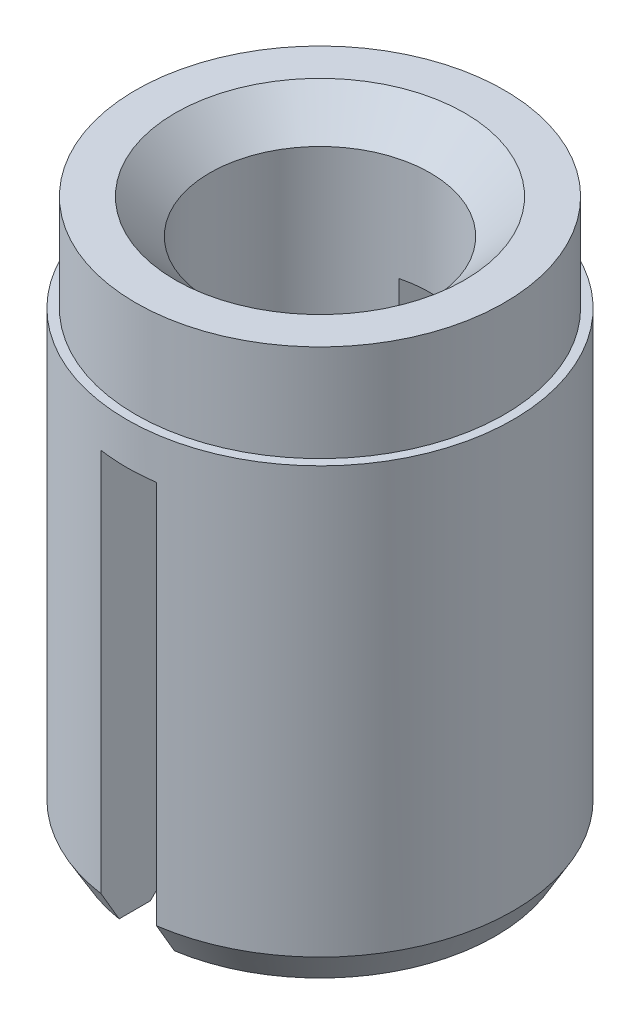
ISO-10303-21;
HEADER;
FILE_DESCRIPTION(('STEP AP214'),'2;1');
FILE_NAME('part.step','',(''),(''),'','','');
FILE_SCHEMA(('AUTOMOTIVE_DESIGN { 1 0 10303 214 1 1 1 1 }'));
ENDSEC;
DATA;
#1=APPLICATION_CONTEXT('core data for automotive mechanical design processes');
#2=APPLICATION_PROTOCOL_DEFINITION('international standard','automotive_design',2000,#1);
#3=PRODUCT_CONTEXT('',#1,'mechanical');
#4=PRODUCT('Part','Part','',(#3));
#5=PRODUCT_RELATED_PRODUCT_CATEGORY('part','',(#4));
#6=PRODUCT_DEFINITION_FORMATION('','',#4);
#7=PRODUCT_DEFINITION_CONTEXT('part definition',#1,'design');
#8=PRODUCT_DEFINITION('design','',#6,#7);
#9=PRODUCT_DEFINITION_SHAPE('','',#8);
#10=(LENGTH_UNIT() NAMED_UNIT(*) SI_UNIT(.MILLI.,.METRE.));
#11=(NAMED_UNIT(*) PLANE_ANGLE_UNIT() SI_UNIT($,.RADIAN.));
#12=(NAMED_UNIT(*) SI_UNIT($,.STERADIAN.) SOLID_ANGLE_UNIT());
#13=UNCERTAINTY_MEASURE_WITH_UNIT(LENGTH_MEASURE(1.E-05),#10,'distance_accuracy_value','');
#14=(GEOMETRIC_REPRESENTATION_CONTEXT(3) GLOBAL_UNCERTAINTY_ASSIGNED_CONTEXT((#13)) GLOBAL_UNIT_ASSIGNED_CONTEXT((#10,
#11,#12)) REPRESENTATION_CONTEXT('',''));
#15=CARTESIAN_POINT('',(0.,0.,0.));
#16=DIRECTION('',(0.,0.,1.));
#17=DIRECTION('',(1.,0.,0.));
#18=AXIS2_PLACEMENT_3D('',#15,#16,#17);
#19=CARTESIAN_POINT('',(0.,-9.525,0.));
#20=DIRECTION('',(0.,1.,0.));
#21=DIRECTION('',(0.,0.,1.));
#22=AXIS2_PLACEMENT_3D('',#19,#20,#21);
#23=CYLINDRICAL_SURFACE('',#22,3.3274);
#24=CARTESIAN_POINT('',(0.,-1.666875,0.));
#25=DIRECTION('',(0.,1.,0.));
#26=DIRECTION('',(0.,0.,1.));
#27=AXIS2_PLACEMENT_3D('',#24,#25,#26);
#28=CIRCLE('',#27,3.3274);
#29=CARTESIAN_POINT('',(0.,-1.666875,3.3274));
#30=VERTEX_POINT('',#29);
#31=EDGE_CURVE('E222',#30,#30,#28,.T.);
#32=ORIENTED_EDGE('',*,*,#31,.F.);
#33=EDGE_LOOP('',(#32));
#34=FACE_BOUND('',#33,.T.);
#35=CARTESIAN_POINT('',(0.,-2.38125,0.));
#36=DIRECTION('',(0.,-1.,0.));
#37=DIRECTION('',(0.,0.,-1.));
#38=AXIS2_PLACEMENT_3D('',#35,#36,#37);
#39=CIRCLE('',#38,3.3274);
#40=CARTESIAN_POINT('',(0.47625,-2.38125,-3.29314085600662));
#41=VERTEX_POINT('',#40);
#42=CARTESIAN_POINT('',(-0.47625,-2.38125,-3.29314085600662));
#43=VERTEX_POINT('',#42);
#44=EDGE_CURVE('E219',#41,#43,#39,.F.);
#45=ORIENTED_EDGE('',*,*,#44,.T.);
#46=DIRECTION('',(0.,1.,0.));
#47=VECTOR('',#46,1.);
#48=CARTESIAN_POINT('',(-0.476249999999999,-9.525,-3.29314085600662));
#49=LINE('',#48,#47);
#50=CARTESIAN_POINT('',(-0.476249999999999,-8.99707091385301,-3.29314085600662));
#51=VERTEX_POINT('',#50);
#52=EDGE_CURVE('E213',#43,#51,#49,.F.);
#53=ORIENTED_EDGE('',*,*,#52,.T.);
#54=CARTESIAN_POINT('',(0.,-8.99707091385301,0.));
#55=DIRECTION('',(0.,1.,0.));
#56=DIRECTION('',(0.,0.,1.));
#57=AXIS2_PLACEMENT_3D('',#54,#55,#56);
#58=CIRCLE('',#57,3.3274);
#59=CARTESIAN_POINT('',(-0.476249999999999,-8.99707091385301,3.29314085600662));
#60=VERTEX_POINT('',#59);
#61=EDGE_CURVE('E147',#51,#60,#58,.T.);
#62=ORIENTED_EDGE('',*,*,#61,.T.);
#63=DIRECTION('',(0.,1.,0.));
#64=VECTOR('',#63,1.);
#65=CARTESIAN_POINT('',(-0.476249999999999,-9.525,3.29314085600662));
#66=LINE('',#65,#64);
#67=CARTESIAN_POINT('',(-0.47625,-2.38125,3.29314085600662));
#68=VERTEX_POINT('',#67);
#69=EDGE_CURVE('E308',#60,#68,#66,.T.);
#70=ORIENTED_EDGE('',*,*,#69,.T.);
#71=CARTESIAN_POINT('',(0.47625,-2.38125,3.29314085600662));
#72=VERTEX_POINT('',#71);
#73=EDGE_CURVE('E221',#68,#72,#39,.F.);
#74=ORIENTED_EDGE('',*,*,#73,.T.);
#75=DIRECTION('',(0.,1.,0.));
#76=VECTOR('',#75,1.);
#77=CARTESIAN_POINT('',(0.476249999999999,-9.525,3.29314085600662));
#78=LINE('',#77,#76);
#79=CARTESIAN_POINT('',(0.476249999999999,-8.99707091385301,3.29314085600662));
#80=VERTEX_POINT('',#79);
#81=EDGE_CURVE('E285',#72,#80,#78,.F.);
#82=ORIENTED_EDGE('',*,*,#81,.T.);
#83=CARTESIAN_POINT('',(0.476249999999999,-8.99707091385301,-3.29314085600662));
#84=VERTEX_POINT('',#83);
#85=EDGE_CURVE('E151',#80,#84,#58,.T.);
#86=ORIENTED_EDGE('',*,*,#85,.T.);
#87=DIRECTION('',(0.,1.,0.));
#88=VECTOR('',#87,1.);
#89=CARTESIAN_POINT('',(0.476249999999999,-9.525,-3.29314085600662));
#90=LINE('',#89,#88);
#91=EDGE_CURVE('E50',#84,#41,#90,.T.);
#92=ORIENTED_EDGE('',*,*,#91,.T.);
#93=EDGE_LOOP('',(#45,#53,#62,#70,#74,#82,#86,#92));
#94=FACE_BOUND('',#93,.T.);
#95=ADVANCED_FACE('F34',(#34,#94),#23,.T.);
#96=CARTESIAN_POINT('',(0.,-9.525,0.));
#97=DIRECTION('',(0.,1.,0.));
#98=DIRECTION('',(0.,0.,1.));
#99=AXIS2_PLACEMENT_3D('',#96,#97,#98);
#100=PLANE('',#99);
#101=DIRECTION('',(0.,0.,-1.));
#102=VECTOR('',#101,1.);
#103=CARTESIAN_POINT('',(-0.476249999999999,-9.525,3.3274));
#104=LINE('',#103,#102);
#105=CARTESIAN_POINT('',(-0.476249999999999,-9.525,2.98484450139367));
#106=VERTEX_POINT('',#105);
#107=CARTESIAN_POINT('',(-0.476249999999999,-9.525,2.44683921850051));
#108=VERTEX_POINT('',#107);
#109=EDGE_CURVE('E288',#106,#108,#104,.T.);
#110=ORIENTED_EDGE('',*,*,#109,.F.);
#111=CARTESIAN_POINT('',(0.,-9.525,0.));
#112=DIRECTION('',(0.,1.,0.));
#113=DIRECTION('',(0.,0.,1.));
#114=AXIS2_PLACEMENT_3D('',#111,#112,#113);
#115=CIRCLE('',#114,3.0226);
#116=CARTESIAN_POINT('',(-0.476249999999999,-9.525,-2.98484450139367));
#117=VERTEX_POINT('',#116);
#118=EDGE_CURVE('E158',#106,#117,#115,.F.);
#119=ORIENTED_EDGE('',*,*,#118,.T.);
#120=CARTESIAN_POINT('',(-0.476249999999999,-9.525,-2.44683921850051));
#121=VERTEX_POINT('',#120);
#122=EDGE_CURVE('E142',#121,#117,#104,.T.);
#123=ORIENTED_EDGE('',*,*,#122,.F.);
#124=CARTESIAN_POINT('',(0.,-9.525,0.));
#125=DIRECTION('',(0.,1.,0.));
#126=DIRECTION('',(0.,0.,1.));
#127=AXIS2_PLACEMENT_3D('',#124,#125,#126);
#128=CIRCLE('',#127,2.49275675180957);
#129=EDGE_CURVE('E148',#121,#108,#128,.T.);
#130=ORIENTED_EDGE('',*,*,#129,.T.);
#131=EDGE_LOOP('',(#110,#119,#123,#130));
#132=FACE_BOUND('',#131,.T.);
#133=ADVANCED_FACE('F253',(#132),#100,.F.);
#134=DIRECTION('',(0.,0.,-1.));
#135=VECTOR('',#134,1.);
#136=CARTESIAN_POINT('',(0.476249999999999,-9.525,3.3274));
#137=LINE('',#136,#135);
#138=CARTESIAN_POINT('',(0.476249999999999,-9.525,-2.44683921850051));
#139=VERTEX_POINT('',#138);
#140=CARTESIAN_POINT('',(0.476249999999999,-9.525,-2.98484450139367));
#141=VERTEX_POINT('',#140);
#142=EDGE_CURVE('E143',#139,#141,#137,.T.);
#143=ORIENTED_EDGE('',*,*,#142,.T.);
#144=CARTESIAN_POINT('',(0.476249999999999,-9.525,2.98484450139367));
#145=VERTEX_POINT('',#144);
#146=EDGE_CURVE('E141',#141,#145,#115,.F.);
#147=ORIENTED_EDGE('',*,*,#146,.T.);
#148=CARTESIAN_POINT('',(0.476249999999999,-9.525,2.44683921850051));
#149=VERTEX_POINT('',#148);
#150=EDGE_CURVE('E58',#145,#149,#137,.T.);
#151=ORIENTED_EDGE('',*,*,#150,.T.);
#152=EDGE_CURVE('E139',#149,#139,#128,.T.);
#153=ORIENTED_EDGE('',*,*,#152,.T.);
#154=EDGE_LOOP('',(#143,#147,#151,#153));
#155=FACE_BOUND('',#154,.T.);
#156=ADVANCED_FACE('F138',(#155),#100,.F.);
#157=CARTESIAN_POINT('',(0.,-9.525,0.));
#158=DIRECTION('',(0.,1.,0.));
#159=DIRECTION('',(0.,0.,1.));
#160=AXIS2_PLACEMENT_3D('',#157,#158,#159);
#161=CYLINDRICAL_SURFACE('',#160,1.89744425180958);
#162=CARTESIAN_POINT('',(0.,-0.595312500000009,0.));
#163=DIRECTION('',(0.,1.,0.));
#164=DIRECTION('',(0.,0.,1.));
#165=AXIS2_PLACEMENT_3D('',#162,#163,#164);
#166=CIRCLE('',#165,1.89744425180958);
#167=CARTESIAN_POINT('',(0.,-0.595312500000009,1.89744425180958));
#168=VERTEX_POINT('',#167);
#169=EDGE_CURVE('E234',#168,#168,#166,.T.);
#170=ORIENTED_EDGE('',*,*,#169,.T.);
#171=EDGE_LOOP('',(#170));
#172=FACE_BOUND('',#171,.T.);
#173=DIRECTION('',(0.,1.,0.));
#174=VECTOR('',#173,1.);
#175=CARTESIAN_POINT('',(-0.476249999999999,-9.525,1.83670373937258));
#176=LINE('',#175,#174);
#177=CARTESIAN_POINT('',(-0.476249999999999,-8.92968750000001,1.83670373937258));
#178=VERTEX_POINT('',#177);
#179=CARTESIAN_POINT('',(-0.47625,-2.38125,1.83670373937258));
#180=VERTEX_POINT('',#179);
#181=EDGE_CURVE('E212',#178,#180,#176,.T.);
#182=ORIENTED_EDGE('',*,*,#181,.F.);
#183=CARTESIAN_POINT('',(0.,-8.92968750000001,0.));
#184=DIRECTION('',(0.,1.,0.));
#185=DIRECTION('',(0.,0.,1.));
#186=AXIS2_PLACEMENT_3D('',#183,#184,#185);
#187=CIRCLE('',#186,1.89744425180958);
#188=CARTESIAN_POINT('',(-0.476249999999999,-8.92968750000001,-1.83670373937258));
#189=VERTEX_POINT('',#188);
#190=EDGE_CURVE('E232',#178,#189,#187,.F.);
#191=ORIENTED_EDGE('',*,*,#190,.T.);
#192=DIRECTION('',(0.,1.,0.));
#193=VECTOR('',#192,1.);
#194=CARTESIAN_POINT('',(-0.476249999999999,-9.525,-1.83670373937258));
#195=LINE('',#194,#193);
#196=CARTESIAN_POINT('',(-0.47625,-2.38125,-1.83670373937258));
#197=VERTEX_POINT('',#196);
#198=EDGE_CURVE('E217',#197,#189,#195,.F.);
#199=ORIENTED_EDGE('',*,*,#198,.F.);
#200=CARTESIAN_POINT('',(0.,-2.38125,0.));
#201=DIRECTION('',(0.,-1.,0.));
#202=DIRECTION('',(0.,0.,-1.));
#203=AXIS2_PLACEMENT_3D('',#200,#201,#202);
#204=CIRCLE('',#203,1.89744425180958);
#205=CARTESIAN_POINT('',(0.47625,-2.38125,-1.83670373937258));
#206=VERTEX_POINT('',#205);
#207=EDGE_CURVE('E39',#206,#197,#204,.F.);
#208=ORIENTED_EDGE('',*,*,#207,.F.);
#209=DIRECTION('',(0.,1.,0.));
#210=VECTOR('',#209,1.);
#211=CARTESIAN_POINT('',(0.476249999999999,-9.525,-1.83670373937258));
#212=LINE('',#211,#210);
#213=CARTESIAN_POINT('',(0.476249999999999,-8.92968750000001,-1.83670373937258));
#214=VERTEX_POINT('',#213);
#215=EDGE_CURVE('E131',#214,#206,#212,.T.);
#216=ORIENTED_EDGE('',*,*,#215,.F.);
#217=CARTESIAN_POINT('',(0.476249999999999,-8.92968750000001,1.83670373937258));
#218=VERTEX_POINT('',#217);
#219=EDGE_CURVE('E231',#214,#218,#187,.F.);
#220=ORIENTED_EDGE('',*,*,#219,.T.);
#221=DIRECTION('',(0.,1.,0.));
#222=VECTOR('',#221,1.);
#223=CARTESIAN_POINT('',(0.476249999999999,-9.525,1.83670373937258));
#224=LINE('',#223,#222);
#225=CARTESIAN_POINT('',(0.47625,-2.38125,1.83670373937258));
#226=VERTEX_POINT('',#225);
#227=EDGE_CURVE('E126',#226,#218,#224,.F.);
#228=ORIENTED_EDGE('',*,*,#227,.F.);
#229=EDGE_CURVE('E11',#180,#226,#204,.F.);
#230=ORIENTED_EDGE('',*,*,#229,.F.);
#231=EDGE_LOOP('',(#182,#191,#199,#208,#216,#220,#228,#230));
#232=FACE_BOUND('',#231,.T.);
#233=ADVANCED_FACE('F199',(#172,#232),#161,.F.);
#234=CARTESIAN_POINT('',(0.,-9.525,0.));
#235=DIRECTION('',(0.,-1.,0.));
#236=DIRECTION('',(0.,0.,-1.));
#237=AXIS2_PLACEMENT_3D('',#234,#235,#236);
#238=CONICAL_SURFACE('',#237,2.49275675180957,0.785398163397447);
#239=ORIENTED_EDGE('',*,*,#129,.F.);
#240=CARTESIAN_POINT('',(-0.476249999999998,-12.5377582272004,-5.48487749376442));
#241=CARTESIAN_POINT('',(-0.476249999999998,-12.3421958835183,-5.28857263664599));
#242=CARTESIAN_POINT('',(-0.476249999999998,-12.1466666458197,-5.09223475393496));
#243=CARTESIAN_POINT('',(-0.476249999999999,-11.7557083241031,-4.69943483667998));
#244=CARTESIAN_POINT('',(-0.476249999999999,-11.5602792471218,-4.50297279513276));
#245=CARTESIAN_POINT('',(-0.476249999999999,-11.1692865374854,-4.10959609100689));
#246=CARTESIAN_POINT('',(-0.476249999999999,-10.9737231430021,-3.91268119162411));
#247=CARTESIAN_POINT('',(-0.476249999999999,-10.5828561938953,-3.51861740838961));
#248=CARTESIAN_POINT('',(-0.476249999999999,-10.3875526241793,-3.32146853951097));
#249=CARTESIAN_POINT('',(-0.476249999999999,-10.0094044900236,-2.93895709515475));
#250=CARTESIAN_POINT('',(-0.476249999999999,-9.82653550338194,-2.7536186904027));
#251=CARTESIAN_POINT('',(-0.476249999999999,-9.55270372098522,-2.47511353124547));
#252=CARTESIAN_POINT('',(-0.476249999999999,-9.46149671461712,-2.3821869884074));
#253=CARTESIAN_POINT('',(-0.476249999999999,-9.27931709644662,-2.19610755257691));
#254=CARTESIAN_POINT('',(-0.476249999999999,-9.18834448053621,-2.10295466360789));
#255=CARTESIAN_POINT('',(-0.476249999999999,-9.006818239051,-1.91640222598002));
#256=CARTESIAN_POINT('',(-0.476249999999999,-8.91626431283668,-1.82300297030996));
#257=CARTESIAN_POINT('',(-0.476249999999999,-8.73567573648136,-1.63569139966826));
#258=CARTESIAN_POINT('',(-0.476249999999999,-8.64564112203174,-1.54177905027635));
#259=CARTESIAN_POINT('',(-0.476249999999999,-8.46645910487272,-1.35316364094734));
#260=CARTESIAN_POINT('',(-0.476249999999999,-8.37731142839893,-1.25846084270699));
#261=CARTESIAN_POINT('',(-0.476249999999999,-8.24481906573573,-1.11527745334938));
#262=CARTESIAN_POINT('',(-0.476249999999999,-8.20086219649471,-1.06736413473043));
#263=CARTESIAN_POINT('',(-0.476249999999999,-8.11354899028808,-0.970994239641913));
#264=CARTESIAN_POINT('',(-0.476249999999999,-8.07019262940917,-0.92253768494482));
#265=CARTESIAN_POINT('',(-0.476249999999999,-8.00330818459592,-0.846358022558352));
#266=CARTESIAN_POINT('',(-0.476249999999999,-7.97946494786844,-0.818911912484312));
#267=CARTESIAN_POINT('',(-0.476249999999999,-7.93215310055029,-0.763693131633271));
#268=CARTESIAN_POINT('',(-0.476249999999999,-7.90868452738946,-0.735920428704207));
#269=CARTESIAN_POINT('',(-0.476249999999999,-7.8619985009703,-0.679653798379081));
#270=CARTESIAN_POINT('',(-0.476249999999999,-7.83878651531073,-0.651155318283005));
#271=CARTESIAN_POINT('',(-0.476249999999999,-7.79307705832612,-0.593599538197383));
#272=CARTESIAN_POINT('',(-0.476249999999999,-7.77057941104951,-0.564542378694359));
#273=CARTESIAN_POINT('',(-0.476249999999999,-7.72633003097644,-0.505307764805173));
#274=CARTESIAN_POINT('',(-0.476249999999999,-7.70459066904915,-0.475120992544507));
#275=CARTESIAN_POINT('',(-0.476249999999999,-7.66263750986186,-0.41363074325207));
#276=CARTESIAN_POINT('',(-0.476249999999999,-7.6424257854053,-0.382325830900518));
#277=CARTESIAN_POINT('',(-0.476249999999999,-7.60465586142537,-0.318584345892397));
#278=CARTESIAN_POINT('',(-0.476249999999999,-7.58707106439127,-0.286163889573184));
#279=CARTESIAN_POINT('',(-0.476249999999999,-7.55582919269119,-0.219523765174281));
#280=CARTESIAN_POINT('',(-0.476249999999999,-7.54215973462603,-0.185310183799499));
#281=CARTESIAN_POINT('',(-0.476249999999999,-7.5219169883853,-0.117896831566755));
#282=CARTESIAN_POINT('',(-0.476249999999999,-7.51483846280601,-0.0848589113805667));
#283=CARTESIAN_POINT('',(-0.476249999999999,-7.50769978820465,-0.0181316176728096));
#284=CARTESIAN_POINT('',(-0.476249999999999,-7.50760582628673,0.0155538275157812));
#285=CARTESIAN_POINT('',(-0.476249999999999,-7.51436305485981,0.0819970851607701));
#286=CARTESIAN_POINT('',(-0.476249999999999,-7.52117933367427,0.11475870963645));
#287=CARTESIAN_POINT('',(-0.476249999999999,-7.5353046365864,0.162776633413977));
#288=CARTESIAN_POINT('',(-0.476249999999999,-7.54069118833409,0.178653298249848));
#289=CARTESIAN_POINT('',(-0.476249999999999,-7.55253650214964,0.210001041082789));
#290=CARTESIAN_POINT('',(-0.476249999999999,-7.55899509088141,0.225472184180577));
#291=CARTESIAN_POINT('',(-0.476249999999999,-7.57826324586494,0.268191336466073));
#292=CARTESIAN_POINT('',(-0.476249999999999,-7.59203334631972,0.295002538161401));
#293=CARTESIAN_POINT('',(-0.476249999999999,-7.62144415296867,0.347589147600735));
#294=CARTESIAN_POINT('',(-0.476249999999999,-7.63708695649459,0.373363349988652));
#295=CARTESIAN_POINT('',(-0.476249999999999,-7.66970284716662,0.424171138396889));
#296=CARTESIAN_POINT('',(-0.476249999999999,-7.68668024762624,0.449201929917659));
#297=CARTESIAN_POINT('',(-0.476249999999999,-7.72154443056746,0.498625085316853));
#298=CARTESIAN_POINT('',(-0.476249999999999,-7.73943143397957,0.523017291891112));
#299=CARTESIAN_POINT('',(-0.476249999999999,-7.79440002761956,0.595906457874034));
#300=CARTESIAN_POINT('',(-0.476249999999999,-7.83247588965576,0.643650343480947));
#301=CARTESIAN_POINT('',(-0.476249999999999,-7.91000349443307,0.737799598846971));
#302=CARTESIAN_POINT('',(-0.476249999999999,-7.94945183348213,0.784207821811764));
#303=CARTESIAN_POINT('',(-0.476249999999999,-8.02840614915809,0.875230170994593));
#304=CARTESIAN_POINT('',(-0.476249999999999,-8.06789245712906,0.919861395244298));
#305=CARTESIAN_POINT('',(-0.476249999999999,-8.14745444298052,1.00859504098575));
#306=CARTESIAN_POINT('',(-0.476249999999999,-8.18753013576042,1.05269744905789));
#307=CARTESIAN_POINT('',(-0.476249999999999,-8.30837602201019,1.18445879356599));
#308=CARTESIAN_POINT('',(-0.476249999999999,-8.38975401436122,1.27155939288686));
#309=CARTESIAN_POINT('',(-0.476249999999999,-8.55347574534256,1.44503893573084));
#310=CARTESIAN_POINT('',(-0.476249999999999,-8.63582051826987,1.53141689678143));
#311=CARTESIAN_POINT('',(-0.476249999999999,-8.80104124844117,1.70365013721165));
#312=CARTESIAN_POINT('',(-0.476249999999999,-8.88391716376963,1.78950545681821));
#313=CARTESIAN_POINT('',(-0.476249999999999,-9.04925545100813,1.96009133766486));
#314=CARTESIAN_POINT('',(-0.476249999999999,-9.13171463854495,2.04482499035852));
#315=CARTESIAN_POINT('',(-0.476249999999999,-9.29687241894031,2.21406188973039));
#316=CARTESIAN_POINT('',(-0.476249999999999,-9.37957101658461,2.29856513173626));
#317=CARTESIAN_POINT('',(-0.476249999999999,-9.62784383682944,2.551751313122));
#318=CARTESIAN_POINT('',(-0.476249999999999,-9.79366968765348,2.72018739315047));
#319=CARTESIAN_POINT('',(-0.476249999999999,-10.172752362559,3.10438488312433));
#320=CARTESIAN_POINT('',(-0.476249999999999,-10.3861297597042,3.32002718373291));
#321=CARTESIAN_POINT('',(-0.476249999999999,-10.813258673112,3.75101017958696));
#322=CARTESIAN_POINT('',(-0.476249999999999,-11.0270102444895,3.96635082018214));
#323=CARTESIAN_POINT('',(-0.476249999999999,-11.4568661363334,4.39898658569903));
#324=CARTESIAN_POINT('',(-0.476249999999999,-11.6729725414757,4.61627963866276));
#325=CARTESIAN_POINT('',(-0.476249999999998,-12.1052927431168,5.05068690264508));
#326=CARTESIAN_POINT('',(-0.476249999999998,-12.3215065157467,5.26780113741533));
#327=CARTESIAN_POINT('',(-0.476249999999998,-12.5377582272004,5.48487749376442));
#328=B_SPLINE_CURVE_WITH_KNOTS('',3,(#240,#241,#242,#243,#244,#245,#246,#247,#248,#249,#250,
#251,#252,#253,#254,#255,#256,#257,#258,#259,#260,#261,#262,#263,#264,#265,#266,#267,#268,#269,
#270,#271,#272,#273,#274,#275,#276,#277,#278,#279,#280,#281,#282,#283,#284,#285,#286,#287,#288,
#289,#290,#291,#292,#293,#294,#295,#296,#297,#298,#299,#300,#301,#302,#303,#304,#305,#306,#307,
#308,#309,#310,#311,#312,#313,#314,#315,#316,#317,#318,#319,#320,#321,#322,#323,#324,#325,#326,
#327),.UNSPECIFIED.,.F.,.F.,(4,2,2,2,2,2,2,2,2,2,2,2,2,2,2,2,2,2,2,2,2,2,2,2,2,2,2,2,2,2,2,2,2,
2,2,2,2,2,2,2,2,2,2,4),(0.,0.831277399611162,1.66260684349829,2.49518381494011,3.32771010470706,
4.10881243292391,4.49943541378387,4.89005150123801,5.28032024795121,5.67061550494561,
6.06078630203573,6.25585016248845,6.45090623269268,6.55997300318477,6.66905060238238,
6.77930884644131,6.88953971827966,7.0011087735471,7.11282659244959,7.2233228771836,
7.3334657256861,7.43422738686845,7.53450121993204,7.63427096532014,7.68453900680781,
7.73479892843226,7.82509868203395,7.91550052984333,8.0062076158438,8.09693683961334,
8.28007625364282,8.46278999288505,8.64155517987871,8.82032489378147,9.17791418673812,
9.5359291491237,9.89391619808931,10.2486180409763,10.6033270239143,11.3124240357664,
12.2225243437058,13.1327724085595,14.0521548673093,14.9713842634699),.UNSPECIFIED.);
#329=EDGE_CURVE('E214',#121,#189,#328,.T.);
#330=ORIENTED_EDGE('',*,*,#329,.T.);
#331=ORIENTED_EDGE('',*,*,#190,.F.);
#332=EDGE_CURVE('E204',#178,#108,#328,.T.);
#333=ORIENTED_EDGE('',*,*,#332,.T.);
#334=EDGE_LOOP('',(#239,#330,#331,#333));
#335=FACE_BOUND('',#334,.T.);
#336=ADVANCED_FACE('F195',(#335),#238,.F.);
#337=ORIENTED_EDGE('',*,*,#152,.F.);
#338=CARTESIAN_POINT('',(0.476249999999998,-12.5377582272004,5.48487749376442));
#339=CARTESIAN_POINT('',(0.476249999999998,-12.3421958835183,5.28857263664599));
#340=CARTESIAN_POINT('',(0.476249999999998,-12.1466666458197,5.09223475393496));
#341=CARTESIAN_POINT('',(0.476249999999998,-11.7557083241031,4.69943483667997));
#342=CARTESIAN_POINT('',(0.476249999999998,-11.5602792471218,4.50297279513276));
#343=CARTESIAN_POINT('',(0.476249999999998,-11.1692865374854,4.10959609100688));
#344=CARTESIAN_POINT('',(0.476249999999998,-10.9737231430021,3.91268119162411));
#345=CARTESIAN_POINT('',(0.476249999999999,-10.5828561938953,3.51861740838961));
#346=CARTESIAN_POINT('',(0.476249999999999,-10.3875526241793,3.32146853951096));
#347=CARTESIAN_POINT('',(0.476249999999999,-10.0094044900236,2.93895709515474));
#348=CARTESIAN_POINT('',(0.476249999999999,-9.82653550338194,2.7536186904027));
#349=CARTESIAN_POINT('',(0.476249999999999,-9.55270372098521,2.47511353124546));
#350=CARTESIAN_POINT('',(0.476249999999999,-9.46149671461711,2.38218698840739));
#351=CARTESIAN_POINT('',(0.476249999999999,-9.27931709644661,2.19610755257691));
#352=CARTESIAN_POINT('',(0.476249999999999,-9.18834448053621,2.10295466360789));
#353=CARTESIAN_POINT('',(0.476249999999999,-9.006818239051,1.91640222598001));
#354=CARTESIAN_POINT('',(0.476249999999999,-8.91626431283667,1.82300297030995));
#355=CARTESIAN_POINT('',(0.476249999999999,-8.73567573648136,1.63569139966826));
#356=CARTESIAN_POINT('',(0.476249999999999,-8.64564112203174,1.54177905027635));
#357=CARTESIAN_POINT('',(0.476249999999999,-8.46645910487272,1.35316364094733));
#358=CARTESIAN_POINT('',(0.476249999999999,-8.37731142839893,1.25846084270699));
#359=CARTESIAN_POINT('',(0.476249999999999,-8.24481906573573,1.11527745334938));
#360=CARTESIAN_POINT('',(0.476249999999999,-8.20086219649471,1.06736413473042));
#361=CARTESIAN_POINT('',(0.476249999999999,-8.11354899028808,0.970994239641911));
#362=CARTESIAN_POINT('',(0.476249999999999,-8.07019262940917,0.922537684944818));
#363=CARTESIAN_POINT('',(0.476249999999999,-8.00330818459592,0.846358022558351));
#364=CARTESIAN_POINT('',(0.476249999999999,-7.97946494786843,0.818911912484312));
#365=CARTESIAN_POINT('',(0.476249999999999,-7.93215310055029,0.76369313163327));
#366=CARTESIAN_POINT('',(0.476249999999999,-7.90868452738946,0.735920428704206));
#367=CARTESIAN_POINT('',(0.476249999999999,-7.8619985009703,0.67965379837908));
#368=CARTESIAN_POINT('',(0.476249999999999,-7.83878651531073,0.651155318283005));
#369=CARTESIAN_POINT('',(0.476249999999999,-7.79307705832612,0.593599538197383));
#370=CARTESIAN_POINT('',(0.476249999999999,-7.77057941104951,0.564542378694359));
#371=CARTESIAN_POINT('',(0.476249999999999,-7.72633003097644,0.505307764805173));
#372=CARTESIAN_POINT('',(0.476249999999999,-7.70459066904915,0.475120992544507));
#373=CARTESIAN_POINT('',(0.476249999999999,-7.66263750986186,0.41363074325207));
#374=CARTESIAN_POINT('',(0.476249999999999,-7.6424257854053,0.382325830900518));
#375=CARTESIAN_POINT('',(0.476249999999999,-7.60465586142537,0.318584345892398));
#376=CARTESIAN_POINT('',(0.476249999999999,-7.58707106439127,0.286163889573185));
#377=CARTESIAN_POINT('',(0.476249999999999,-7.55582919269119,0.219523765174282));
#378=CARTESIAN_POINT('',(0.476249999999999,-7.54215973462603,0.1853101837995));
#379=CARTESIAN_POINT('',(0.476249999999999,-7.5219169883853,0.117896831566756));
#380=CARTESIAN_POINT('',(0.476249999999999,-7.51483846280601,0.0848589113805678));
#381=CARTESIAN_POINT('',(0.476249999999999,-7.50769978820465,0.0181316176728105));
#382=CARTESIAN_POINT('',(0.476249999999999,-7.50760582628673,-0.0155538275157808));
#383=CARTESIAN_POINT('',(0.476249999999999,-7.51436305485981,-0.0819970851607701));
#384=CARTESIAN_POINT('',(0.476249999999999,-7.52117933367427,-0.11475870963645));
#385=CARTESIAN_POINT('',(0.476249999999999,-7.5353046365864,-0.162776633413978));
#386=CARTESIAN_POINT('',(0.476249999999999,-7.54069118833409,-0.178653298249849));
#387=CARTESIAN_POINT('',(0.476249999999999,-7.55253650214964,-0.210001041082789));
#388=CARTESIAN_POINT('',(0.476249999999999,-7.55899509088141,-0.225472184180577));
#389=CARTESIAN_POINT('',(0.476249999999999,-7.57826324586494,-0.268191336466073));
#390=CARTESIAN_POINT('',(0.476249999999999,-7.59203334631972,-0.2950025381614));
#391=CARTESIAN_POINT('',(0.476249999999999,-7.62144415296867,-0.347589147600735));
#392=CARTESIAN_POINT('',(0.476249999999999,-7.63708695649459,-0.373363349988652));
#393=CARTESIAN_POINT('',(0.476249999999999,-7.66970284716662,-0.424171138396889));
#394=CARTESIAN_POINT('',(0.476249999999999,-7.68668024762624,-0.44920192991766));
#395=CARTESIAN_POINT('',(0.476249999999999,-7.72154443056746,-0.498625085316855));
#396=CARTESIAN_POINT('',(0.476249999999999,-7.73943143397957,-0.523017291891114));
#397=CARTESIAN_POINT('',(0.476249999999999,-7.79440002761956,-0.595906457874035));
#398=CARTESIAN_POINT('',(0.476249999999999,-7.83247588965576,-0.643650343480948));
#399=CARTESIAN_POINT('',(0.476249999999999,-7.91000349443307,-0.737799598846972));
#400=CARTESIAN_POINT('',(0.476249999999999,-7.94945183348213,-0.784207821811765));
#401=CARTESIAN_POINT('',(0.476249999999999,-8.02840614915809,-0.875230170994595));
#402=CARTESIAN_POINT('',(0.476249999999999,-8.06789245712906,-0.9198613952443));
#403=CARTESIAN_POINT('',(0.476249999999999,-8.14745444298052,-1.00859504098575));
#404=CARTESIAN_POINT('',(0.476249999999999,-8.18753013576042,-1.05269744905789));
#405=CARTESIAN_POINT('',(0.476249999999999,-8.3083760220102,-1.18445879356599));
#406=CARTESIAN_POINT('',(0.476249999999999,-8.38975401436122,-1.27155939288686));
#407=CARTESIAN_POINT('',(0.476249999999999,-8.55347574534256,-1.44503893573084));
#408=CARTESIAN_POINT('',(0.476249999999999,-8.63582051826987,-1.53141689678143));
#409=CARTESIAN_POINT('',(0.476249999999999,-8.80104124844117,-1.70365013721165));
#410=CARTESIAN_POINT('',(0.476249999999999,-8.88391716376964,-1.78950545681821));
#411=CARTESIAN_POINT('',(0.476249999999999,-9.04925545100814,-1.96009133766486));
#412=CARTESIAN_POINT('',(0.476249999999999,-9.13171463854496,-2.04482499035852));
#413=CARTESIAN_POINT('',(0.476249999999999,-9.29687241894032,-2.21406188973039));
#414=CARTESIAN_POINT('',(0.476249999999999,-9.37957101658461,-2.29856513173626));
#415=CARTESIAN_POINT('',(0.476249999999999,-9.62784383682944,-2.55175131312201));
#416=CARTESIAN_POINT('',(0.476249999999999,-9.79366968765348,-2.72018739315047));
#417=CARTESIAN_POINT('',(0.476249999999999,-10.172752362559,-3.10438488312434));
#418=CARTESIAN_POINT('',(0.476249999999999,-10.3861297597042,-3.32002718373292));
#419=CARTESIAN_POINT('',(0.476249999999999,-10.813258673112,-3.75101017958696));
#420=CARTESIAN_POINT('',(0.476249999999999,-11.0270102444895,-3.96635082018214));
#421=CARTESIAN_POINT('',(0.476249999999998,-11.4568661363334,-4.39898658569903));
#422=CARTESIAN_POINT('',(0.476249999999998,-11.6729725414757,-4.61627963866275));
#423=CARTESIAN_POINT('',(0.476249999999998,-12.1052927431168,-5.05068690264508));
#424=CARTESIAN_POINT('',(0.476249999999998,-12.3215065157467,-5.26780113741533));
#425=CARTESIAN_POINT('',(0.476249999999998,-12.5377582272004,-5.48487749376442));
#426=B_SPLINE_CURVE_WITH_KNOTS('',3,(#338,#339,#340,#341,#342,#343,#344,#345,#346,#347,#348,
#349,#350,#351,#352,#353,#354,#355,#356,#357,#358,#359,#360,#361,#362,#363,#364,#365,#366,#367,
#368,#369,#370,#371,#372,#373,#374,#375,#376,#377,#378,#379,#380,#381,#382,#383,#384,#385,#386,
#387,#388,#389,#390,#391,#392,#393,#394,#395,#396,#397,#398,#399,#400,#401,#402,#403,#404,#405,
#406,#407,#408,#409,#410,#411,#412,#413,#414,#415,#416,#417,#418,#419,#420,#421,#422,#423,#424,
#425),.UNSPECIFIED.,.F.,.F.,(4,2,2,2,2,2,2,2,2,2,2,2,2,2,2,2,2,2,2,2,2,2,2,2,2,2,2,2,2,2,2,2,2,
2,2,2,2,2,2,2,2,2,2,4),(0.,0.831277399611162,1.66260684349829,2.49518381494011,3.32771010470706,
4.10881243292392,4.49943541378388,4.89005150123801,5.28032024795121,5.67061550494561,
6.06078630203573,6.25585016248845,6.45090623269267,6.55997300318477,6.66905060238237,
6.7793088464413,6.88953971827966,7.00110877354709,7.11282659244959,7.22332287718359,
7.3334657256861,7.43422738686844,7.53450121993204,7.63427096532013,7.6845390068078,
7.73479892843225,7.82509868203394,7.91550052984332,8.00620761584379,8.09693683961333,
8.28007625364281,8.46278999288504,8.6415551798787,8.82032489378147,9.17791418673812,
9.5359291491237,9.8939161980893,10.2486180409762,10.6033270239143,11.3124240357664,
12.2225243437058,13.1327724085595,14.0521548673093,14.9713842634699),.UNSPECIFIED.);
#427=EDGE_CURVE('E122',#149,#218,#426,.T.);
#428=ORIENTED_EDGE('',*,*,#427,.T.);
#429=ORIENTED_EDGE('',*,*,#219,.F.);
#430=EDGE_CURVE('E133',#214,#139,#426,.T.);
#431=ORIENTED_EDGE('',*,*,#430,.T.);
#432=EDGE_LOOP('',(#337,#428,#429,#431));
#433=FACE_BOUND('',#432,.T.);
#434=ADVANCED_FACE('F146',(#433),#238,.F.);
#435=CARTESIAN_POINT('',(0.,-8.99707091385301,0.));
#436=DIRECTION('',(0.,1.,0.));
#437=DIRECTION('',(0.,0.,1.));
#438=AXIS2_PLACEMENT_3D('',#435,#436,#437);
#439=CONICAL_SURFACE('',#438,3.3274,0.523598775598303);
#440=ORIENTED_EDGE('',*,*,#61,.F.);
#441=CARTESIAN_POINT('',(-0.476249999999999,-6.07066408617989,-4.9943058913413));
#442=CARTESIAN_POINT('',(-0.476249999999999,-6.36021693246138,-4.82636860839638));
#443=CARTESIAN_POINT('',(-0.476249999999999,-6.6497412061615,-4.65838199711443));
#444=CARTESIAN_POINT('',(-0.476249999999999,-7.22869411058676,-4.32225170719463));
#445=CARTESIAN_POINT('',(-0.476249999999999,-7.51812274237207,-4.15410803038271));
#446=CARTESIAN_POINT('',(-0.476249999999999,-8.09683831172936,-3.81760960419695));
#447=CARTESIAN_POINT('',(-0.476249999999999,-8.38612525555985,-3.64925486559031));
#448=CARTESIAN_POINT('',(-0.476249999999999,-8.96451004430714,-3.31221324753551));
#449=CARTESIAN_POINT('',(-0.476249999999999,-9.25360788702568,-3.14352636431454));
#450=CARTESIAN_POINT('',(-0.476249999999999,-9.83152730361156,-2.8056198561999));
#451=CARTESIAN_POINT('',(-0.476249999999999,-10.1203488503052,-2.63640018477508));
#452=CARTESIAN_POINT('',(-0.476249999999999,-10.5531747296866,-2.38188942423438));
#453=CARTESIAN_POINT('',(-0.476249999999999,-10.6973800709421,-2.29694027180526));
#454=CARTESIAN_POINT('',(-0.476249999999999,-10.9856035267952,-2.12672189462073));
#455=CARTESIAN_POINT('',(-0.476249999999999,-11.1296216397826,-2.04145266713674));
#456=CARTESIAN_POINT('',(-0.476249999999999,-11.4174013208026,-1.87044874193216));
#457=CARTESIAN_POINT('',(-0.476249999999999,-11.5611628610831,-1.78471399748605));
#458=CARTESIAN_POINT('',(-0.476249999999999,-11.8482736908882,-1.61256290370853));
#459=CARTESIAN_POINT('',(-0.476249999999999,-11.9916229900645,-1.52614657051547));
#460=CARTESIAN_POINT('',(-0.476249999999998,-12.2061479966789,-1.39568209750929));
#461=CARTESIAN_POINT('',(-0.476249999999998,-12.2775773565457,-1.35205135660396));
#462=CARTESIAN_POINT('',(-0.476249999999998,-12.4202062203638,-1.26441746032628));
#463=CARTESIAN_POINT('',(-0.476249999999998,-12.4914057269997,-1.22041430932534));
#464=CARTESIAN_POINT('',(-0.476249999999998,-12.6335031414979,-1.13190901036702));
#465=CARTESIAN_POINT('',(-0.476249999999998,-12.704401023939,-1.08740682145611));
#466=CARTESIAN_POINT('',(-0.476249999999998,-12.8457398396348,-0.997677168291782));
#467=CARTESIAN_POINT('',(-0.476249999999998,-12.9161807541074,-0.952449674488967));
#468=CARTESIAN_POINT('',(-0.476249999999998,-12.9863155665121,-0.906746404500955));
#469=B_SPLINE_CURVE_WITH_KNOTS('',3,(#441,#442,#443,#444,#445,#446,#447,#448,#449,#450,#451,
#452,#453,#454,#455,#456,#457,#458,#459,#460,#461,#462,#463,#464,#465,#466,#467,#468),
.UNSPECIFIED.,.F.,.F.,(4,2,2,2,2,2,2,2,2,2,2,2,2,4),(0.,1.00418828887457,2.00836504567447,
3.01249250550935,4.01663143772801,5.02086064407218,5.52295982376749,6.02506329354525,
6.52721812883132,7.02936110980017,7.28046210312953,7.53156015307579,7.78267896241274,
8.03380802861497),.UNSPECIFIED.);
#470=EDGE_CURVE('E316',#51,#117,#469,.T.);
#471=ORIENTED_EDGE('',*,*,#470,.T.);
#472=ORIENTED_EDGE('',*,*,#118,.F.);
#473=CARTESIAN_POINT('',(-0.476249999999998,-12.9863155665121,0.906746404500955));
#474=CARTESIAN_POINT('',(-0.476249999999998,-12.9386298380401,0.937836292160516));
#475=CARTESIAN_POINT('',(-0.476249999999998,-12.890794483794,0.968694813370326));
#476=CARTESIAN_POINT('',(-0.476249999999998,-12.7948856220397,1.03003747764372));
#477=CARTESIAN_POINT('',(-0.476249999999998,-12.7468121197066,1.06052162879312));
#478=CARTESIAN_POINT('',(-0.476249999999998,-12.6023287545377,1.15154338250692));
#479=CARTESIAN_POINT('',(-0.476249999999998,-12.5056502495189,1.21165402534775));
#480=CARTESIAN_POINT('',(-0.476249999999998,-12.3118513219494,1.33113350901182));
#481=CARTESIAN_POINT('',(-0.476249999999998,-12.2147309462544,1.39050242609659));
#482=CARTESIAN_POINT('',(-0.476249999999998,-12.0201790488796,1.50873205973917));
#483=CARTESIAN_POINT('',(-0.476249999999999,-11.9227475211608,1.56759276635021));
#484=CARTESIAN_POINT('',(-0.476249999999999,-11.6359080476765,1.74016044490128));
#485=CARTESIAN_POINT('',(-0.476249999999999,-11.4462018888453,1.85337128319791));
#486=CARTESIAN_POINT('',(-0.476249999999999,-11.0663330148421,2.07902057280857));
#487=CARTESIAN_POINT('',(-0.476249999999999,-10.8761703015906,2.19145902736417));
#488=CARTESIAN_POINT('',(-0.476249999999999,-10.305222743865,2.52808145010884));
#489=CARTESIAN_POINT('',(-0.476249999999999,-9.92401627670519,2.75154993782995));
#490=CARTESIAN_POINT('',(-0.476249999999999,-9.25357182431953,3.14354145905981));
#491=CARTESIAN_POINT('',(-0.476249999999999,-8.96444257896325,3.31225100207975));
#492=CARTESIAN_POINT('',(-0.476249999999999,-8.38598909755184,3.64933576819747));
#493=CARTESIAN_POINT('',(-0.476249999999999,-8.09666486146565,3.81771099124198));
#494=CARTESIAN_POINT('',(-0.476249999999999,-7.5179453468931,4.15421064506904));
#495=CARTESIAN_POINT('',(-0.476249999999999,-7.22855009288038,4.32233511796787));
#496=CARTESIAN_POINT('',(-0.476249999999999,-6.64966754786151,4.65842496649969));
#497=CARTESIAN_POINT('',(-0.476249999999999,-6.36018025693634,4.82639034227215));
#498=CARTESIAN_POINT('',(-0.476249999999999,-6.07066408617989,4.9943058913413));
#499=B_SPLINE_CURVE_WITH_KNOTS('',3,(#473,#474,#475,#476,#477,#478,#479,#480,#481,#482,#483,
#484,#485,#486,#487,#488,#489,#490,#491,#492,#493,#494,#495,#496,#497,#498),.UNSPECIFIED.,.F.,
.F.,(4,2,2,2,2,2,2,2,2,2,2,2,4),(0.,0.170774265503769,0.341544836039695,0.683065315197661,
1.02455038660935,1.36604212653575,2.02879472963437,2.69154454956059,4.01717620513763,
5.02143103533534,6.02568602555313,7.02974727469356,8.03380764284208),.UNSPECIFIED.);
#500=EDGE_CURVE('E317',#106,#60,#499,.T.);
#501=ORIENTED_EDGE('',*,*,#500,.T.);
#502=EDGE_LOOP('',(#440,#471,#472,#501));
#503=FACE_BOUND('',#502,.T.);
#504=ADVANCED_FACE('F36',(#503),#439,.T.);
#505=ORIENTED_EDGE('',*,*,#146,.F.);
#506=CARTESIAN_POINT('',(0.476249999999998,-12.9863155665121,-0.906746404500955));
#507=CARTESIAN_POINT('',(0.476249999999998,-12.9386298380401,-0.937836292160516));
#508=CARTESIAN_POINT('',(0.476249999999998,-12.890794483794,-0.968694813370326));
#509=CARTESIAN_POINT('',(0.476249999999998,-12.7948856220397,-1.03003747764372));
#510=CARTESIAN_POINT('',(0.476249999999998,-12.7468121197066,-1.06052162879312));
#511=CARTESIAN_POINT('',(0.476249999999998,-12.6023287545377,-1.15154338250692));
#512=CARTESIAN_POINT('',(0.476249999999998,-12.5056502495189,-1.21165402534775));
#513=CARTESIAN_POINT('',(0.476249999999998,-12.3118513219494,-1.33113350901182));
#514=CARTESIAN_POINT('',(0.476249999999998,-12.2147309462544,-1.39050242609659));
#515=CARTESIAN_POINT('',(0.476249999999998,-12.0201790488796,-1.50873205973917));
#516=CARTESIAN_POINT('',(0.476249999999998,-11.9227475211608,-1.56759276635021));
#517=CARTESIAN_POINT('',(0.476249999999998,-11.6359080476765,-1.74016044490128));
#518=CARTESIAN_POINT('',(0.476249999999998,-11.4462018888453,-1.85337128319791));
#519=CARTESIAN_POINT('',(0.476249999999998,-11.0663330148421,-2.07902057280857));
#520=CARTESIAN_POINT('',(0.476249999999999,-10.8761703015906,-2.19145902736417));
#521=CARTESIAN_POINT('',(0.476249999999999,-10.305222743865,-2.52808145010884));
#522=CARTESIAN_POINT('',(0.476249999999999,-9.92401627670519,-2.75154993782995));
#523=CARTESIAN_POINT('',(0.476249999999999,-9.25357182431953,-3.14354145905981));
#524=CARTESIAN_POINT('',(0.476249999999999,-8.96444257896325,-3.31225100207975));
#525=CARTESIAN_POINT('',(0.476249999999999,-8.38598909755184,-3.64933576819747));
#526=CARTESIAN_POINT('',(0.476249999999999,-8.09666486146565,-3.81771099124198));
#527=CARTESIAN_POINT('',(0.476249999999999,-7.5179453468931,-4.15421064506904));
#528=CARTESIAN_POINT('',(0.476249999999999,-7.22855009288038,-4.32233511796787));
#529=CARTESIAN_POINT('',(0.476249999999999,-6.64966754786151,-4.65842496649969));
#530=CARTESIAN_POINT('',(0.476249999999999,-6.36018025693634,-4.82639034227215));
#531=CARTESIAN_POINT('',(0.476249999999999,-6.07066408617989,-4.9943058913413));
#532=B_SPLINE_CURVE_WITH_KNOTS('',3,(#506,#507,#508,#509,#510,#511,#512,#513,#514,#515,#516,
#517,#518,#519,#520,#521,#522,#523,#524,#525,#526,#527,#528,#529,#530,#531),.UNSPECIFIED.,.F.,
.F.,(4,2,2,2,2,2,2,2,2,2,2,2,4),(0.,0.170774265503769,0.341544836039695,0.683065315197661,
1.02455038660935,1.36604212653575,2.02879472963437,2.69154454956059,4.01717620513763,
5.02143103533534,6.02568602555313,7.02974727469356,8.03380764284208),.UNSPECIFIED.);
#533=EDGE_CURVE('E168',#141,#84,#532,.T.);
#534=ORIENTED_EDGE('',*,*,#533,.T.);
#535=ORIENTED_EDGE('',*,*,#85,.F.);
#536=CARTESIAN_POINT('',(0.476249999999999,-6.07066408617989,4.9943058913413));
#537=CARTESIAN_POINT('',(0.476249999999999,-6.36021693246138,4.82636860839638));
#538=CARTESIAN_POINT('',(0.476249999999999,-6.6497412061615,4.65838199711443));
#539=CARTESIAN_POINT('',(0.476249999999999,-7.22869411058676,4.32225170719463));
#540=CARTESIAN_POINT('',(0.476249999999999,-7.51812274237207,4.15410803038271));
#541=CARTESIAN_POINT('',(0.476249999999999,-8.09683831172936,3.81760960419695));
#542=CARTESIAN_POINT('',(0.476249999999999,-8.38612525555985,3.64925486559031));
#543=CARTESIAN_POINT('',(0.476249999999999,-8.96451004430714,3.31221324753551));
#544=CARTESIAN_POINT('',(0.476249999999999,-9.25360788702568,3.14352636431454));
#545=CARTESIAN_POINT('',(0.476249999999999,-9.83152730361156,2.8056198561999));
#546=CARTESIAN_POINT('',(0.476249999999999,-10.1203488503052,2.63640018477508));
#547=CARTESIAN_POINT('',(0.476249999999999,-10.5531747296866,2.38188942423438));
#548=CARTESIAN_POINT('',(0.476249999999999,-10.6973800709421,2.29694027180526));
#549=CARTESIAN_POINT('',(0.476249999999998,-10.9856035267952,2.12672189462073));
#550=CARTESIAN_POINT('',(0.476249999999998,-11.1296216397826,2.04145266713674));
#551=CARTESIAN_POINT('',(0.476249999999998,-11.4174013208026,1.87044874193216));
#552=CARTESIAN_POINT('',(0.476249999999998,-11.5611628610831,1.78471399748605));
#553=CARTESIAN_POINT('',(0.476249999999998,-11.8482736908882,1.61256290370853));
#554=CARTESIAN_POINT('',(0.476249999999998,-11.9916229900645,1.52614657051547));
#555=CARTESIAN_POINT('',(0.476249999999998,-12.2061479966789,1.39568209750929));
#556=CARTESIAN_POINT('',(0.476249999999998,-12.2775773565457,1.35205135660396));
#557=CARTESIAN_POINT('',(0.476249999999998,-12.4202062203638,1.26441746032628));
#558=CARTESIAN_POINT('',(0.476249999999998,-12.4914057269997,1.22041430932534));
#559=CARTESIAN_POINT('',(0.476249999999998,-12.6335031414979,1.13190901036702));
#560=CARTESIAN_POINT('',(0.476249999999998,-12.704401023939,1.08740682145611));
#561=CARTESIAN_POINT('',(0.476249999999998,-12.8457398396348,0.997677168291782));
#562=CARTESIAN_POINT('',(0.476249999999998,-12.9161807541074,0.952449674488967));
#563=CARTESIAN_POINT('',(0.476249999999998,-12.9863155665121,0.906746404500955));
#564=B_SPLINE_CURVE_WITH_KNOTS('',3,(#536,#537,#538,#539,#540,#541,#542,#543,#544,#545,#546,
#547,#548,#549,#550,#551,#552,#553,#554,#555,#556,#557,#558,#559,#560,#561,#562,#563),
.UNSPECIFIED.,.F.,.F.,(4,2,2,2,2,2,2,2,2,2,2,2,2,4),(0.,1.00418828887457,2.00836504567447,
3.01249250550935,4.01663143772801,5.02086064407218,5.52295982376749,6.02506329354526,
6.52721812883132,7.02936110980018,7.28046210312953,7.5315601530758,7.78267896241274,
8.03380802861497),.UNSPECIFIED.);
#565=EDGE_CURVE('E161',#80,#145,#564,.T.);
#566=ORIENTED_EDGE('',*,*,#565,.T.);
#567=EDGE_LOOP('',(#505,#534,#535,#566));
#568=FACE_BOUND('',#567,.T.);
#569=ADVANCED_FACE('F267',(#568),#439,.T.);
#570=CARTESIAN_POINT('',(0.,-9.525,0.));
#571=DIRECTION('',(0.,1.,0.));
#572=DIRECTION('',(0.,0.,1.));
#573=AXIS2_PLACEMENT_3D('',#570,#571,#572);
#574=CYLINDRICAL_SURFACE('',#573,3.175);
#575=CARTESIAN_POINT('',(0.,-1.666875,0.));
#576=DIRECTION('',(0.,1.,0.));
#577=DIRECTION('',(0.,0.,1.));
#578=AXIS2_PLACEMENT_3D('',#575,#576,#577);
#579=CIRCLE('',#578,3.175);
#580=CARTESIAN_POINT('',(0.,-1.666875,3.175));
#581=VERTEX_POINT('',#580);
#582=EDGE_CURVE('E228',#581,#581,#579,.F.);
#583=ORIENTED_EDGE('',*,*,#582,.F.);
#584=EDGE_LOOP('',(#583));
#585=FACE_BOUND('',#584,.T.);
#586=CARTESIAN_POINT('',(0.,0.,0.));
#587=DIRECTION('',(0.,1.,0.));
#588=DIRECTION('',(0.,0.,1.));
#589=AXIS2_PLACEMENT_3D('',#586,#587,#588);
#590=CIRCLE('',#589,3.175);
#591=CARTESIAN_POINT('',(0.,0.,3.175));
#592=VERTEX_POINT('',#591);
#593=EDGE_CURVE('E225',#592,#592,#590,.T.);
#594=ORIENTED_EDGE('',*,*,#593,.F.);
#595=EDGE_LOOP('',(#594));
#596=FACE_BOUND('',#595,.T.);
#597=ADVANCED_FACE('F265',(#585,#596),#574,.T.);
#598=CARTESIAN_POINT('',(0.,0.,0.));
#599=DIRECTION('',(0.,1.,0.));
#600=DIRECTION('',(0.,0.,1.));
#601=AXIS2_PLACEMENT_3D('',#598,#599,#600);
#602=PLANE('',#601);
#603=CARTESIAN_POINT('',(0.,0.,0.));
#604=DIRECTION('',(0.,1.,0.));
#605=DIRECTION('',(0.,0.,1.));
#606=AXIS2_PLACEMENT_3D('',#603,#604,#605);
#607=CIRCLE('',#606,2.49275675180959);
#608=CARTESIAN_POINT('',(0.,0.,2.49275675180959));
#609=VERTEX_POINT('',#608);
#610=EDGE_CURVE('E154',#609,#609,#607,.F.);
#611=ORIENTED_EDGE('',*,*,#610,.T.);
#612=EDGE_LOOP('',(#611));
#613=FACE_BOUND('',#612,.T.);
#614=ORIENTED_EDGE('',*,*,#593,.T.);
#615=EDGE_LOOP('',(#614));
#616=FACE_BOUND('',#615,.T.);
#617=ADVANCED_FACE('F241',(#613,#616),#602,.T.);
#618=CARTESIAN_POINT('',(0.,-1.666875,0.));
#619=DIRECTION('',(0.,1.,0.));
#620=DIRECTION('',(0.,0.,1.));
#621=AXIS2_PLACEMENT_3D('',#618,#619,#620);
#622=PLANE('',#621);
#623=ORIENTED_EDGE('',*,*,#582,.T.);
#624=EDGE_LOOP('',(#623));
#625=FACE_BOUND('',#624,.T.);
#626=ORIENTED_EDGE('',*,*,#31,.T.);
#627=EDGE_LOOP('',(#626));
#628=FACE_BOUND('',#627,.T.);
#629=ADVANCED_FACE('F246',(#625,#628),#622,.T.);
#630=CARTESIAN_POINT('',(0.,-0.595312500000009,0.));
#631=DIRECTION('',(0.,1.,0.));
#632=DIRECTION('',(0.,0.,1.));
#633=AXIS2_PLACEMENT_3D('',#630,#631,#632);
#634=CONICAL_SURFACE('',#633,1.89744425180958,0.78539816339745);
#635=ORIENTED_EDGE('',*,*,#610,.F.);
#636=EDGE_LOOP('',(#635));
#637=FACE_BOUND('',#636,.T.);
#638=ORIENTED_EDGE('',*,*,#169,.F.);
#639=EDGE_LOOP('',(#638));
#640=FACE_BOUND('',#639,.T.);
#641=ADVANCED_FACE('F179',(#637,#640),#634,.F.);
#642=CARTESIAN_POINT('',(0.47625,-2.38125,3.3274));
#643=DIRECTION('',(-1.,0.,0.));
#644=DIRECTION('',(0.,-1.,0.));
#645=AXIS2_PLACEMENT_3D('',#642,#643,#644);
#646=PLANE('',#645);
#647=ORIENTED_EDGE('',*,*,#227,.T.);
#648=ORIENTED_EDGE('',*,*,#427,.F.);
#649=ORIENTED_EDGE('',*,*,#150,.F.);
#650=ORIENTED_EDGE('',*,*,#565,.F.);
#651=ORIENTED_EDGE('',*,*,#81,.F.);
#652=DIRECTION('',(0.,0.,-1.));
#653=VECTOR('',#652,1.);
#654=CARTESIAN_POINT('',(0.47625,-2.38125,3.3274));
#655=LINE('',#654,#653);
#656=EDGE_CURVE('E291',#72,#226,#655,.T.);
#657=ORIENTED_EDGE('',*,*,#656,.T.);
#658=EDGE_LOOP('',(#647,#648,#649,#650,#651,#657));
#659=FACE_BOUND('',#658,.T.);
#660=ADVANCED_FACE('F123',(#659),#646,.T.);
#661=CARTESIAN_POINT('',(-0.47625,-2.38125,3.3274));
#662=DIRECTION('',(1.,0.,0.));
#663=DIRECTION('',(0.,1.,0.));
#664=AXIS2_PLACEMENT_3D('',#661,#662,#663);
#665=PLANE('',#664);
#666=ORIENTED_EDGE('',*,*,#181,.T.);
#667=DIRECTION('',(0.,0.,-1.));
#668=VECTOR('',#667,1.);
#669=CARTESIAN_POINT('',(-0.47625,-2.38125,3.3274));
#670=LINE('',#669,#668);
#671=EDGE_CURVE('E294',#68,#180,#670,.T.);
#672=ORIENTED_EDGE('',*,*,#671,.F.);
#673=ORIENTED_EDGE('',*,*,#69,.F.);
#674=ORIENTED_EDGE('',*,*,#500,.F.);
#675=ORIENTED_EDGE('',*,*,#109,.T.);
#676=ORIENTED_EDGE('',*,*,#332,.F.);
#677=EDGE_LOOP('',(#666,#672,#673,#674,#675,#676));
#678=FACE_BOUND('',#677,.T.);
#679=ADVANCED_FACE('F178',(#678),#665,.T.);
#680=CARTESIAN_POINT('',(-0.47625,-2.38125,3.3274));
#681=DIRECTION('',(0.,-1.,0.));
#682=DIRECTION('',(0.,0.,-1.));
#683=AXIS2_PLACEMENT_3D('',#680,#681,#682);
#684=PLANE('',#683);
#685=ORIENTED_EDGE('',*,*,#671,.T.);
#686=ORIENTED_EDGE('',*,*,#229,.T.);
#687=ORIENTED_EDGE('',*,*,#656,.F.);
#688=ORIENTED_EDGE('',*,*,#73,.F.);
#689=EDGE_LOOP('',(#685,#686,#687,#688));
#690=FACE_BOUND('',#689,.T.);
#691=ADVANCED_FACE('F181',(#690),#684,.T.);
#692=ORIENTED_EDGE('',*,*,#44,.F.);
#693=EDGE_CURVE('E292',#206,#41,#655,.T.);
#694=ORIENTED_EDGE('',*,*,#693,.F.);
#695=ORIENTED_EDGE('',*,*,#207,.T.);
#696=EDGE_CURVE('E295',#197,#43,#670,.T.);
#697=ORIENTED_EDGE('',*,*,#696,.T.);
#698=EDGE_LOOP('',(#692,#694,#695,#697));
#699=FACE_BOUND('',#698,.T.);
#700=ADVANCED_FACE('F329',(#699),#684,.T.);
#701=ORIENTED_EDGE('',*,*,#198,.T.);
#702=ORIENTED_EDGE('',*,*,#329,.F.);
#703=ORIENTED_EDGE('',*,*,#122,.T.);
#704=ORIENTED_EDGE('',*,*,#470,.F.);
#705=ORIENTED_EDGE('',*,*,#52,.F.);
#706=ORIENTED_EDGE('',*,*,#696,.F.);
#707=EDGE_LOOP('',(#701,#702,#703,#704,#705,#706));
#708=FACE_BOUND('',#707,.T.);
#709=ADVANCED_FACE('F182',(#708),#665,.T.);
#710=ORIENTED_EDGE('',*,*,#215,.T.);
#711=ORIENTED_EDGE('',*,*,#693,.T.);
#712=ORIENTED_EDGE('',*,*,#91,.F.);
#713=ORIENTED_EDGE('',*,*,#533,.F.);
#714=ORIENTED_EDGE('',*,*,#142,.F.);
#715=ORIENTED_EDGE('',*,*,#430,.F.);
#716=EDGE_LOOP('',(#710,#711,#712,#713,#714,#715));
#717=FACE_BOUND('',#716,.T.);
#718=ADVANCED_FACE('F180',(#717),#646,.T.);
#719=CLOSED_SHELL('',(#95,#133,#156,#233,#336,#434,#504,#569,#597,#617,#629,#641,#660,#679,#691,
#700,#709,#718));
#720=MANIFOLD_SOLID_BREP('B2',#719);
#721=ADVANCED_BREP_SHAPE_REPRESENTATION('',(#18,#720),#14);
#722=SHAPE_DEFINITION_REPRESENTATION(#9,#721);
ENDSEC;
END-ISO-10303-21;
